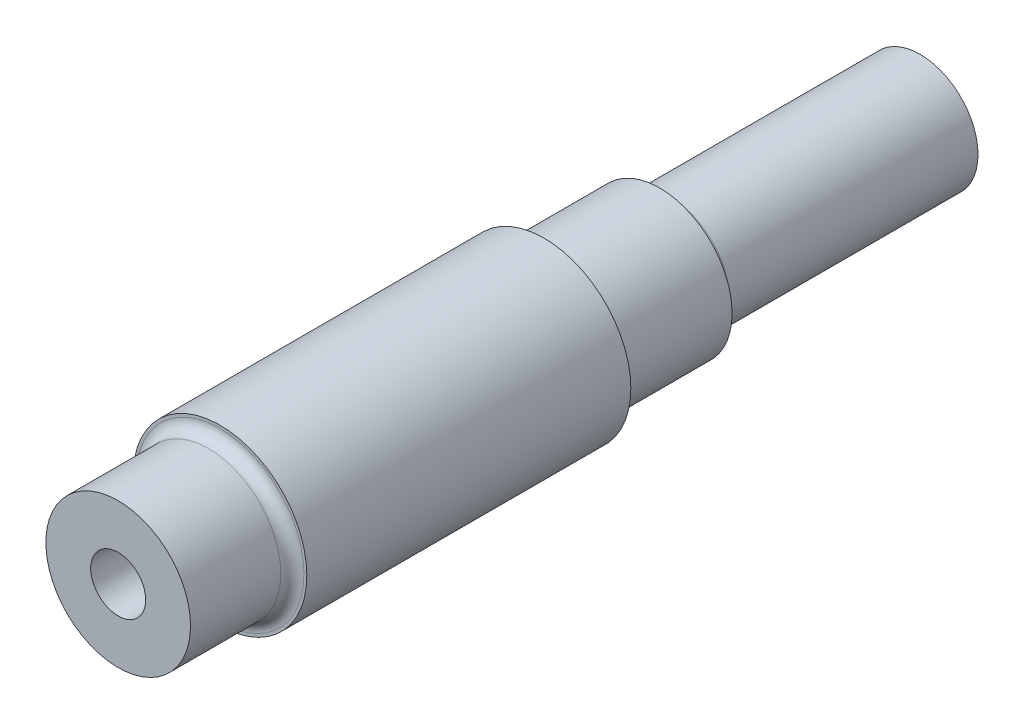
ISO-10303-21;
HEADER;
FILE_DESCRIPTION(('STEP AP214'),'2;1');
FILE_NAME('part.step','',(''),(''),'','','');
FILE_SCHEMA(('AUTOMOTIVE_DESIGN { 1 0 10303 214 1 1 1 1 }'));
ENDSEC;
DATA;
#1=APPLICATION_CONTEXT('core data for automotive mechanical design processes');
#2=APPLICATION_PROTOCOL_DEFINITION('international standard','automotive_design',2000,#1);
#3=PRODUCT_CONTEXT('',#1,'mechanical');
#4=PRODUCT('Part','Part','',(#3));
#5=PRODUCT_RELATED_PRODUCT_CATEGORY('part','',(#4));
#6=PRODUCT_DEFINITION_FORMATION('','',#4);
#7=PRODUCT_DEFINITION_CONTEXT('part definition',#1,'design');
#8=PRODUCT_DEFINITION('design','',#6,#7);
#9=PRODUCT_DEFINITION_SHAPE('','',#8);
#10=(LENGTH_UNIT() NAMED_UNIT(*) SI_UNIT(.MILLI.,.METRE.));
#11=(NAMED_UNIT(*) PLANE_ANGLE_UNIT() SI_UNIT($,.RADIAN.));
#12=(NAMED_UNIT(*) SI_UNIT($,.STERADIAN.) SOLID_ANGLE_UNIT());
#13=UNCERTAINTY_MEASURE_WITH_UNIT(LENGTH_MEASURE(1.E-05),#10,'distance_accuracy_value','');
#14=(GEOMETRIC_REPRESENTATION_CONTEXT(3) GLOBAL_UNCERTAINTY_ASSIGNED_CONTEXT((#13)) GLOBAL_UNIT_ASSIGNED_CONTEXT((#10,
#11,#12)) REPRESENTATION_CONTEXT('',''));
#15=CARTESIAN_POINT('',(0.,0.,0.));
#16=DIRECTION('',(0.,0.,1.));
#17=DIRECTION('',(1.,0.,0.));
#18=AXIS2_PLACEMENT_3D('',#15,#16,#17);
#19=CARTESIAN_POINT('',(0.,0.,93.6));
#20=DIRECTION('',(0.,0.,-1.));
#21=DIRECTION('',(-1.,0.,0.));
#22=AXIS2_PLACEMENT_3D('',#19,#20,#21);
#23=CYLINDRICAL_SURFACE('',#22,12.5);
#24=CARTESIAN_POINT('',(0.,0.,18.5));
#25=DIRECTION('',(0.,0.,1.));
#26=DIRECTION('',(1.,0.,0.));
#27=AXIS2_PLACEMENT_3D('',#24,#25,#26);
#28=CIRCLE('',#27,12.5);
#29=CARTESIAN_POINT('',(12.5,0.,18.5));
#30=VERTEX_POINT('',#29);
#31=EDGE_CURVE('E41',#30,#30,#28,.F.);
#32=ORIENTED_EDGE('',*,*,#31,.T.);
#33=EDGE_LOOP('',(#32));
#34=FACE_BOUND('',#33,.T.);
#35=CARTESIAN_POINT('',(0.,0.,0.));
#36=DIRECTION('',(0.,0.,1.));
#37=DIRECTION('',(1.,0.,0.));
#38=AXIS2_PLACEMENT_3D('',#35,#36,#37);
#39=CIRCLE('',#38,12.5);
#40=CARTESIAN_POINT('',(12.5,0.,0.));
#41=VERTEX_POINT('',#40);
#42=EDGE_CURVE('E57',#41,#41,#39,.T.);
#43=ORIENTED_EDGE('',*,*,#42,.T.);
#44=EDGE_LOOP('',(#43));
#45=FACE_BOUND('',#44,.T.);
#46=ADVANCED_FACE('F30',(#34,#45),#23,.T.);
#47=CARTESIAN_POINT('',(0.,0.,0.));
#48=DIRECTION('',(0.,0.,1.));
#49=DIRECTION('',(1.,0.,0.));
#50=AXIS2_PLACEMENT_3D('',#47,#48,#49);
#51=PLANE('',#50);
#52=CARTESIAN_POINT('',(0.,0.,0.));
#53=DIRECTION('',(0.,0.,1.));
#54=DIRECTION('',(1.,0.,0.));
#55=AXIS2_PLACEMENT_3D('',#52,#53,#54);
#56=CIRCLE('',#55,12.);
#57=CARTESIAN_POINT('',(12.,0.,0.));
#58=VERTEX_POINT('',#57);
#59=EDGE_CURVE('E10',#58,#58,#56,.T.);
#60=ORIENTED_EDGE('',*,*,#59,.T.);
#61=EDGE_LOOP('',(#60));
#62=FACE_BOUND('',#61,.T.);
#63=ORIENTED_EDGE('',*,*,#42,.F.);
#64=EDGE_LOOP('',(#63));
#65=FACE_BOUND('',#64,.T.);
#66=ADVANCED_FACE('F106',(#62,#65),#51,.F.);
#67=CARTESIAN_POINT('',(0.,0.,20.));
#68=DIRECTION('',(0.,0.,1.));
#69=DIRECTION('',(1.,0.,0.));
#70=AXIS2_PLACEMENT_3D('',#67,#68,#69);
#71=CYLINDRICAL_SURFACE('',#70,15.);
#72=CARTESIAN_POINT('',(0.,0.,20.));
#73=DIRECTION('',(0.,0.,1.));
#74=DIRECTION('',(1.,0.,0.));
#75=AXIS2_PLACEMENT_3D('',#72,#73,#74);
#76=CIRCLE('',#75,15.);
#77=CARTESIAN_POINT('',(15.,0.,20.));
#78=VERTEX_POINT('',#77);
#79=EDGE_CURVE('E60',#78,#78,#76,.T.);
#80=ORIENTED_EDGE('',*,*,#79,.T.);
#81=EDGE_LOOP('',(#80));
#82=FACE_BOUND('',#81,.T.);
#83=CARTESIAN_POINT('',(0.,0.,76.));
#84=DIRECTION('',(0.,0.,1.));
#85=DIRECTION('',(1.,0.,0.));
#86=AXIS2_PLACEMENT_3D('',#83,#84,#85);
#87=CIRCLE('',#86,15.);
#88=CARTESIAN_POINT('',(15.,0.,76.));
#89=VERTEX_POINT('',#88);
#90=EDGE_CURVE('E63',#89,#89,#87,.T.);
#91=ORIENTED_EDGE('',*,*,#90,.F.);
#92=EDGE_LOOP('',(#91));
#93=FACE_BOUND('',#92,.T.);
#94=ADVANCED_FACE('F111',(#82,#93),#71,.T.);
#95=CARTESIAN_POINT('',(0.,0.,20.));
#96=DIRECTION('',(0.,0.,1.));
#97=DIRECTION('',(1.,0.,0.));
#98=AXIS2_PLACEMENT_3D('',#95,#96,#97);
#99=PLANE('',#98);
#100=CARTESIAN_POINT('',(0.,0.,20.));
#101=DIRECTION('',(0.,0.,1.));
#102=DIRECTION('',(1.,0.,0.));
#103=AXIS2_PLACEMENT_3D('',#100,#101,#102);
#104=CIRCLE('',#103,14.);
#105=CARTESIAN_POINT('',(14.,0.,20.));
#106=VERTEX_POINT('',#105);
#107=EDGE_CURVE('E45',#106,#106,#104,.T.);
#108=ORIENTED_EDGE('',*,*,#107,.T.);
#109=EDGE_LOOP('',(#108));
#110=FACE_BOUND('',#109,.T.);
#111=ORIENTED_EDGE('',*,*,#79,.F.);
#112=EDGE_LOOP('',(#111));
#113=FACE_BOUND('',#112,.T.);
#114=ADVANCED_FACE('F123',(#110,#113),#99,.F.);
#115=CARTESIAN_POINT('',(0.,0.,76.));
#116=DIRECTION('',(0.,0.,1.));
#117=DIRECTION('',(1.,0.,0.));
#118=AXIS2_PLACEMENT_3D('',#115,#116,#117);
#119=PLANE('',#118);
#120=CARTESIAN_POINT('',(0.,0.,76.));
#121=DIRECTION('',(0.,0.,1.));
#122=DIRECTION('',(1.,0.,0.));
#123=AXIS2_PLACEMENT_3D('',#120,#121,#122);
#124=CIRCLE('',#123,14.5);
#125=CARTESIAN_POINT('',(14.5,0.,76.));
#126=VERTEX_POINT('',#125);
#127=EDGE_CURVE('E50',#126,#126,#124,.F.);
#128=ORIENTED_EDGE('',*,*,#127,.T.);
#129=EDGE_LOOP('',(#128));
#130=FACE_BOUND('',#129,.T.);
#131=ORIENTED_EDGE('',*,*,#90,.T.);
#132=EDGE_LOOP('',(#131));
#133=FACE_BOUND('',#132,.T.);
#134=ADVANCED_FACE('F91',(#130,#133),#119,.T.);
#135=CARTESIAN_POINT('',(0.,0.,93.6));
#136=DIRECTION('',(0.,0.,1.));
#137=DIRECTION('',(1.,0.,0.));
#138=AXIS2_PLACEMENT_3D('',#135,#136,#137);
#139=PLANE('',#138);
#140=CARTESIAN_POINT('',(0.,0.,93.6));
#141=DIRECTION('',(0.,0.,1.));
#142=DIRECTION('',(1.,0.,0.));
#143=AXIS2_PLACEMENT_3D('',#140,#141,#142);
#144=CIRCLE('',#143,4.755);
#145=CARTESIAN_POINT('',(4.755,0.,93.6));
#146=VERTEX_POINT('',#145);
#147=EDGE_CURVE('E72',#146,#146,#144,.T.);
#148=ORIENTED_EDGE('',*,*,#147,.F.);
#149=EDGE_LOOP('',(#148));
#150=FACE_BOUND('',#149,.T.);
#151=CARTESIAN_POINT('',(0.,0.,93.6));
#152=DIRECTION('',(0.,0.,1.));
#153=DIRECTION('',(1.,0.,0.));
#154=AXIS2_PLACEMENT_3D('',#151,#152,#153);
#155=CIRCLE('',#154,12.5);
#156=CARTESIAN_POINT('',(12.5,0.,93.6));
#157=VERTEX_POINT('',#156);
#158=EDGE_CURVE('E56',#157,#157,#155,.T.);
#159=ORIENTED_EDGE('',*,*,#158,.T.);
#160=EDGE_LOOP('',(#159));
#161=FACE_BOUND('',#160,.T.);
#162=ADVANCED_FACE('F87',(#150,#161),#139,.T.);
#163=CARTESIAN_POINT('',(0.,0.,78.));
#164=DIRECTION('',(0.,0.,1.));
#165=DIRECTION('',(1.,0.,0.));
#166=AXIS2_PLACEMENT_3D('',#163,#164,#165);
#167=CIRCLE('',#166,12.5);
#168=CARTESIAN_POINT('',(12.5,0.,78.));
#169=VERTEX_POINT('',#168);
#170=EDGE_CURVE('E53',#169,#169,#167,.T.);
#171=ORIENTED_EDGE('',*,*,#170,.T.);
#172=EDGE_LOOP('',(#171));
#173=FACE_BOUND('',#172,.T.);
#174=ORIENTED_EDGE('',*,*,#158,.F.);
#175=EDGE_LOOP('',(#174));
#176=FACE_BOUND('',#175,.T.);
#177=ADVANCED_FACE('F90',(#173,#176),#23,.T.);
#178=CARTESIAN_POINT('',(0.,0.,-45.));
#179=DIRECTION('',(0.,0.,1.));
#180=DIRECTION('',(1.,0.,0.));
#181=AXIS2_PLACEMENT_3D('',#178,#179,#180);
#182=CYLINDRICAL_SURFACE('',#181,10.);
#183=CARTESIAN_POINT('',(0.,0.,-2.));
#184=DIRECTION('',(0.,0.,1.));
#185=DIRECTION('',(1.,0.,0.));
#186=AXIS2_PLACEMENT_3D('',#183,#184,#185);
#187=CIRCLE('',#186,10.);
#188=CARTESIAN_POINT('',(10.,0.,-2.));
#189=VERTEX_POINT('',#188);
#190=EDGE_CURVE('E37',#189,#189,#187,.F.);
#191=ORIENTED_EDGE('',*,*,#190,.T.);
#192=EDGE_LOOP('',(#191));
#193=FACE_BOUND('',#192,.T.);
#194=CARTESIAN_POINT('',(0.,0.,-45.));
#195=DIRECTION('',(0.,0.,-1.));
#196=DIRECTION('',(-1.,0.,0.));
#197=AXIS2_PLACEMENT_3D('',#194,#195,#196);
#198=CIRCLE('',#197,10.);
#199=CARTESIAN_POINT('',(-10.,0.,-45.));
#200=VERTEX_POINT('',#199);
#201=EDGE_CURVE('E66',#200,#200,#198,.T.);
#202=ORIENTED_EDGE('',*,*,#201,.F.);
#203=EDGE_LOOP('',(#202));
#204=FACE_BOUND('',#203,.T.);
#205=ADVANCED_FACE('F96',(#193,#204),#182,.T.);
#206=CARTESIAN_POINT('',(0.,0.,-45.));
#207=DIRECTION('',(0.,0.,-1.));
#208=DIRECTION('',(-1.,0.,0.));
#209=AXIS2_PLACEMENT_3D('',#206,#207,#208);
#210=PLANE('',#209);
#211=ORIENTED_EDGE('',*,*,#201,.T.);
#212=EDGE_LOOP('',(#211));
#213=FACE_BOUND('',#212,.T.);
#214=ADVANCED_FACE('F83',(#213),#210,.T.);
#215=CARTESIAN_POINT('',(0.,0.,33.6));
#216=DIRECTION('',(0.,0.,1.));
#217=DIRECTION('',(1.,0.,0.));
#218=AXIS2_PLACEMENT_3D('',#215,#216,#217);
#219=CYLINDRICAL_SURFACE('',#218,4.755);
#220=CARTESIAN_POINT('',(0.,0.,33.6));
#221=DIRECTION('',(0.,0.,1.));
#222=DIRECTION('',(1.,0.,0.));
#223=AXIS2_PLACEMENT_3D('',#220,#221,#222);
#224=CIRCLE('',#223,4.755);
#225=CARTESIAN_POINT('',(4.755,0.,33.6));
#226=VERTEX_POINT('',#225);
#227=EDGE_CURVE('E71',#226,#226,#224,.T.);
#228=ORIENTED_EDGE('',*,*,#227,.F.);
#229=EDGE_LOOP('',(#228));
#230=FACE_BOUND('',#229,.T.);
#231=ORIENTED_EDGE('',*,*,#147,.T.);
#232=EDGE_LOOP('',(#231));
#233=FACE_BOUND('',#232,.T.);
#234=ADVANCED_FACE('F80',(#230,#233),#219,.F.);
#235=CARTESIAN_POINT('',(0.,0.,33.6));
#236=DIRECTION('',(0.,0.,1.));
#237=DIRECTION('',(1.,0.,0.));
#238=AXIS2_PLACEMENT_3D('',#235,#236,#237);
#239=PLANE('',#238);
#240=ORIENTED_EDGE('',*,*,#227,.T.);
#241=EDGE_LOOP('',(#240));
#242=FACE_BOUND('',#241,.T.);
#243=ADVANCED_FACE('F78',(#242),#239,.T.);
#244=CARTESIAN_POINT('',(0.,0.,78.));
#245=DIRECTION('',(0.,0.,1.));
#246=DIRECTION('',(1.,0.,0.));
#247=AXIS2_PLACEMENT_3D('',#244,#245,#246);
#248=TOROIDAL_SURFACE('',#247,14.5,2.);
#249=ORIENTED_EDGE('',*,*,#127,.F.);
#250=EDGE_LOOP('',(#249));
#251=FACE_BOUND('',#250,.T.);
#252=ORIENTED_EDGE('',*,*,#170,.F.);
#253=EDGE_LOOP('',(#252));
#254=FACE_BOUND('',#253,.T.);
#255=ADVANCED_FACE('F120',(#251,#254),#248,.F.);
#256=CARTESIAN_POINT('',(0.,0.,18.5));
#257=DIRECTION('',(0.,0.,1.));
#258=DIRECTION('',(1.,0.,0.));
#259=AXIS2_PLACEMENT_3D('',#256,#257,#258);
#260=TOROIDAL_SURFACE('',#259,14.,1.5);
#261=ORIENTED_EDGE('',*,*,#31,.F.);
#262=EDGE_LOOP('',(#261));
#263=FACE_BOUND('',#262,.T.);
#264=ORIENTED_EDGE('',*,*,#107,.F.);
#265=EDGE_LOOP('',(#264));
#266=FACE_BOUND('',#265,.T.);
#267=ADVANCED_FACE('F117',(#263,#266),#260,.F.);
#268=CARTESIAN_POINT('',(0.,0.,-2.));
#269=DIRECTION('',(0.,0.,1.));
#270=DIRECTION('',(1.,0.,0.));
#271=AXIS2_PLACEMENT_3D('',#268,#269,#270);
#272=TOROIDAL_SURFACE('',#271,12.,2.);
#273=ORIENTED_EDGE('',*,*,#59,.F.);
#274=EDGE_LOOP('',(#273));
#275=FACE_BOUND('',#274,.T.);
#276=ORIENTED_EDGE('',*,*,#190,.F.);
#277=EDGE_LOOP('',(#276));
#278=FACE_BOUND('',#277,.T.);
#279=ADVANCED_FACE('F32',(#275,#278),#272,.F.);
#280=CLOSED_SHELL('',(#46,#66,#94,#114,#134,#162,#177,#205,#214,#234,#243,#255,#267,#279));
#281=MANIFOLD_SOLID_BREP('B2',#280);
#282=ADVANCED_BREP_SHAPE_REPRESENTATION('',(#18,#281),#14);
#283=SHAPE_DEFINITION_REPRESENTATION(#9,#282);
ENDSEC;
END-ISO-10303-21;
